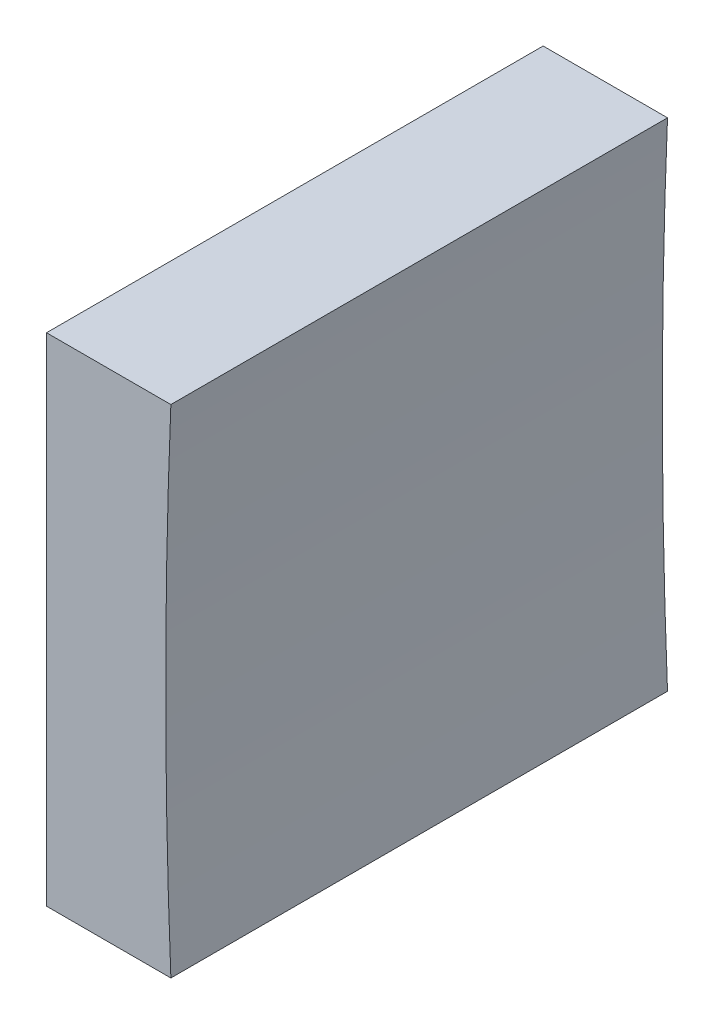
ISO-10303-21;
HEADER;
FILE_DESCRIPTION(('STEP AP214'),'2;1');
FILE_NAME('part.step','',(''),(''),'','','');
FILE_SCHEMA(('AUTOMOTIVE_DESIGN { 1 0 10303 214 1 1 1 1 }'));
ENDSEC;
DATA;
#1=APPLICATION_CONTEXT('core data for automotive mechanical design processes');
#2=APPLICATION_PROTOCOL_DEFINITION('international standard','automotive_design',2000,#1);
#3=PRODUCT_CONTEXT('',#1,'mechanical');
#4=PRODUCT('Part','Part','',(#3));
#5=PRODUCT_RELATED_PRODUCT_CATEGORY('part','',(#4));
#6=PRODUCT_DEFINITION_FORMATION('','',#4);
#7=PRODUCT_DEFINITION_CONTEXT('part definition',#1,'design');
#8=PRODUCT_DEFINITION('design','',#6,#7);
#9=PRODUCT_DEFINITION_SHAPE('','',#8);
#10=(LENGTH_UNIT() NAMED_UNIT(*) SI_UNIT(.MILLI.,.METRE.));
#11=(NAMED_UNIT(*) PLANE_ANGLE_UNIT() SI_UNIT($,.RADIAN.));
#12=(NAMED_UNIT(*) SI_UNIT($,.STERADIAN.) SOLID_ANGLE_UNIT());
#13=UNCERTAINTY_MEASURE_WITH_UNIT(LENGTH_MEASURE(1.E-05),#10,'distance_accuracy_value','');
#14=(GEOMETRIC_REPRESENTATION_CONTEXT(3) GLOBAL_UNCERTAINTY_ASSIGNED_CONTEXT((#13)) GLOBAL_UNIT_ASSIGNED_CONTEXT((#10,
#11,#12)) REPRESENTATION_CONTEXT('',''));
#15=CARTESIAN_POINT('',(0.,0.,0.));
#16=DIRECTION('',(0.,0.,1.));
#17=DIRECTION('',(1.,0.,0.));
#18=AXIS2_PLACEMENT_3D('',#15,#16,#17);
#19=CARTESIAN_POINT('',(145.483832712118,27.1789646338835,12.5));
#20=DIRECTION('',(0.,1.,0.));
#21=DIRECTION('',(-1.,0.,0.));
#22=AXIS2_PLACEMENT_3D('',#19,#20,#21);
#23=PLANE('',#22);
#24=DIRECTION('',(1.,0.,0.));
#25=VECTOR('',#24,1.);
#26=CARTESIAN_POINT('',(145.483832712118,27.1789646338835,0.));
#27=LINE('',#26,#25);
#28=CARTESIAN_POINT('',(142.353567815641,27.1789646338835,0.));
#29=VERTEX_POINT('',#28);
#30=CARTESIAN_POINT('',(145.483832712118,27.1789646338836,0.));
#31=VERTEX_POINT('',#30);
#32=EDGE_CURVE('E91',#29,#31,#27,.T.);
#33=ORIENTED_EDGE('',*,*,#32,.T.);
#34=DIRECTION('',(0.,0.,-1.));
#35=VECTOR('',#34,1.);
#36=CARTESIAN_POINT('',(145.483832712118,27.1789646338836,12.5));
#37=LINE('',#36,#35);
#38=CARTESIAN_POINT('',(145.483832712118,27.1789646338836,12.5));
#39=VERTEX_POINT('',#38);
#40=EDGE_CURVE('E45',#39,#31,#37,.T.);
#41=ORIENTED_EDGE('',*,*,#40,.F.);
#42=DIRECTION('',(1.,0.,0.));
#43=VECTOR('',#42,1.);
#44=CARTESIAN_POINT('',(145.483832712118,27.1789646338835,12.5));
#45=LINE('',#44,#43);
#46=CARTESIAN_POINT('',(142.353567815641,27.1789646338835,12.5));
#47=VERTEX_POINT('',#46);
#48=EDGE_CURVE('E84',#47,#39,#45,.T.);
#49=ORIENTED_EDGE('',*,*,#48,.F.);
#50=DIRECTION('',(0.,0.,-1.));
#51=VECTOR('',#50,1.);
#52=CARTESIAN_POINT('',(142.353567815641,27.1789646338835,12.5));
#53=LINE('',#52,#51);
#54=EDGE_CURVE('E11',#47,#29,#53,.T.);
#55=ORIENTED_EDGE('',*,*,#54,.T.);
#56=EDGE_LOOP('',(#33,#41,#49,#55));
#57=FACE_BOUND('',#56,.T.);
#58=ADVANCED_FACE('F37',(#57),#23,.F.);
#59=CARTESIAN_POINT('',(295.353567815641,33.4289646338835,12.5));
#60=DIRECTION('',(0.,0.,-1.));
#61=DIRECTION('',(-1.,0.,0.));
#62=AXIS2_PLACEMENT_3D('',#59,#60,#61);
#63=CYLINDRICAL_SURFACE('',#62,150.);
#64=CARTESIAN_POINT('',(295.353567815641,33.4289646338835,0.));
#65=DIRECTION('',(0.,0.,-1.));
#66=DIRECTION('',(1.,0.,0.));
#67=AXIS2_PLACEMENT_3D('',#64,#65,#66);
#68=CIRCLE('',#67,150.);
#69=CARTESIAN_POINT('',(145.483832712118,39.6789646338835,0.));
#70=VERTEX_POINT('',#69);
#71=EDGE_CURVE('E71',#31,#70,#68,.T.);
#72=ORIENTED_EDGE('',*,*,#71,.T.);
#73=DIRECTION('',(0.,0.,-1.));
#74=VECTOR('',#73,1.);
#75=CARTESIAN_POINT('',(145.483832712118,39.6789646338835,12.5));
#76=LINE('',#75,#74);
#77=CARTESIAN_POINT('',(145.483832712118,39.6789646338835,12.5));
#78=VERTEX_POINT('',#77);
#79=EDGE_CURVE('E92',#78,#70,#76,.T.);
#80=ORIENTED_EDGE('',*,*,#79,.F.);
#81=CARTESIAN_POINT('',(295.353567815641,33.4289646338835,12.5));
#82=DIRECTION('',(0.,0.,-1.));
#83=DIRECTION('',(1.,0.,0.));
#84=AXIS2_PLACEMENT_3D('',#81,#82,#83);
#85=CIRCLE('',#84,150.);
#86=EDGE_CURVE('E88',#39,#78,#85,.T.);
#87=ORIENTED_EDGE('',*,*,#86,.F.);
#88=ORIENTED_EDGE('',*,*,#40,.T.);
#89=EDGE_LOOP('',(#72,#80,#87,#88));
#90=FACE_BOUND('',#89,.T.);
#91=ADVANCED_FACE('F93',(#90),#63,.F.);
#92=CARTESIAN_POINT('',(142.353567815641,39.6789646338835,12.5));
#93=DIRECTION('',(0.,-1.,0.));
#94=DIRECTION('',(0.,0.,-1.));
#95=AXIS2_PLACEMENT_3D('',#92,#93,#94);
#96=PLANE('',#95);
#97=DIRECTION('',(-1.,0.,0.));
#98=VECTOR('',#97,1.);
#99=CARTESIAN_POINT('',(142.353567815641,39.6789646338835,0.));
#100=LINE('',#99,#98);
#101=CARTESIAN_POINT('',(142.353567815641,39.6789646338835,0.));
#102=VERTEX_POINT('',#101);
#103=EDGE_CURVE('E78',#70,#102,#100,.T.);
#104=ORIENTED_EDGE('',*,*,#103,.T.);
#105=DIRECTION('',(0.,0.,-1.));
#106=VECTOR('',#105,1.);
#107=CARTESIAN_POINT('',(142.353567815641,39.6789646338835,12.5));
#108=LINE('',#107,#106);
#109=CARTESIAN_POINT('',(142.353567815641,39.6789646338835,12.5));
#110=VERTEX_POINT('',#109);
#111=EDGE_CURVE('E97',#110,#102,#108,.T.);
#112=ORIENTED_EDGE('',*,*,#111,.F.);
#113=DIRECTION('',(-1.,0.,0.));
#114=VECTOR('',#113,1.);
#115=CARTESIAN_POINT('',(142.353567815641,39.6789646338835,12.5));
#116=LINE('',#115,#114);
#117=EDGE_CURVE('E95',#78,#110,#116,.T.);
#118=ORIENTED_EDGE('',*,*,#117,.F.);
#119=ORIENTED_EDGE('',*,*,#79,.T.);
#120=EDGE_LOOP('',(#104,#112,#118,#119));
#121=FACE_BOUND('',#120,.T.);
#122=ADVANCED_FACE('F107',(#121),#96,.F.);
#123=CARTESIAN_POINT('',(142.353567815641,33.4289646338835,12.5));
#124=DIRECTION('',(1.,0.,0.));
#125=DIRECTION('',(0.,0.,-1.));
#126=AXIS2_PLACEMENT_3D('',#123,#124,#125);
#127=PLANE('',#126);
#128=DIRECTION('',(0.,-1.,0.));
#129=VECTOR('',#128,1.);
#130=CARTESIAN_POINT('',(142.353567815641,33.4289646338835,0.));
#131=LINE('',#130,#129);
#132=EDGE_CURVE('E104',#102,#29,#131,.T.);
#133=ORIENTED_EDGE('',*,*,#132,.T.);
#134=ORIENTED_EDGE('',*,*,#54,.F.);
#135=DIRECTION('',(0.,-1.,0.));
#136=VECTOR('',#135,1.);
#137=CARTESIAN_POINT('',(142.353567815641,27.1789646338835,12.5));
#138=LINE('',#137,#136);
#139=EDGE_CURVE('E53',#110,#47,#138,.T.);
#140=ORIENTED_EDGE('',*,*,#139,.F.);
#141=ORIENTED_EDGE('',*,*,#111,.T.);
#142=EDGE_LOOP('',(#133,#134,#140,#141));
#143=FACE_BOUND('',#142,.T.);
#144=ADVANCED_FACE('F111',(#143),#127,.F.);
#145=CARTESIAN_POINT('',(295.353567815641,33.4289646338835,12.5));
#146=DIRECTION('',(0.,0.,1.));
#147=DIRECTION('',(1.,0.,0.));
#148=AXIS2_PLACEMENT_3D('',#145,#146,#147);
#149=PLANE('',#148);
#150=ORIENTED_EDGE('',*,*,#139,.T.);
#151=ORIENTED_EDGE('',*,*,#48,.T.);
#152=ORIENTED_EDGE('',*,*,#86,.T.);
#153=ORIENTED_EDGE('',*,*,#117,.T.);
#154=EDGE_LOOP('',(#150,#151,#152,#153));
#155=FACE_BOUND('',#154,.T.);
#156=ADVANCED_FACE('F86',(#155),#149,.T.);
#157=CARTESIAN_POINT('',(295.353567815641,33.4289646338835,0.));
#158=DIRECTION('',(0.,0.,1.));
#159=DIRECTION('',(1.,0.,0.));
#160=AXIS2_PLACEMENT_3D('',#157,#158,#159);
#161=PLANE('',#160);
#162=ORIENTED_EDGE('',*,*,#32,.F.);
#163=ORIENTED_EDGE('',*,*,#132,.F.);
#164=ORIENTED_EDGE('',*,*,#103,.F.);
#165=ORIENTED_EDGE('',*,*,#71,.F.);
#166=EDGE_LOOP('',(#162,#163,#164,#165));
#167=FACE_BOUND('',#166,.T.);
#168=ADVANCED_FACE('F110',(#167),#161,.F.);
#169=CLOSED_SHELL('',(#58,#91,#122,#144,#156,#168));
#170=MANIFOLD_SOLID_BREP('B2',#169);
#171=ADVANCED_BREP_SHAPE_REPRESENTATION('',(#18,#170),#14);
#172=SHAPE_DEFINITION_REPRESENTATION(#9,#171);
ENDSEC;
END-ISO-10303-21;
